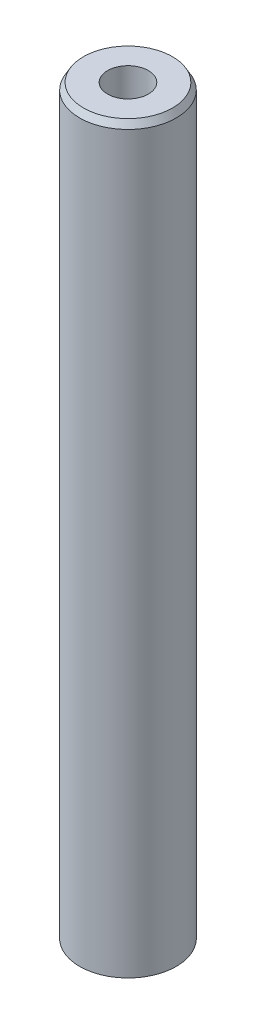
ISO-10303-21;
HEADER;
FILE_DESCRIPTION(('STEP AP214'),'2;1');
FILE_NAME('part.step','',(''),(''),'','','');
FILE_SCHEMA(('AUTOMOTIVE_DESIGN { 1 0 10303 214 1 1 1 1 }'));
ENDSEC;
DATA;
#1=APPLICATION_CONTEXT('core data for automotive mechanical design processes');
#2=APPLICATION_PROTOCOL_DEFINITION('international standard','automotive_design',2000,#1);
#3=PRODUCT_CONTEXT('',#1,'mechanical');
#4=PRODUCT('Part','Part','',(#3));
#5=PRODUCT_RELATED_PRODUCT_CATEGORY('part','',(#4));
#6=PRODUCT_DEFINITION_FORMATION('','',#4);
#7=PRODUCT_DEFINITION_CONTEXT('part definition',#1,'design');
#8=PRODUCT_DEFINITION('design','',#6,#7);
#9=PRODUCT_DEFINITION_SHAPE('','',#8);
#10=(LENGTH_UNIT() NAMED_UNIT(*) SI_UNIT(.MILLI.,.METRE.));
#11=(NAMED_UNIT(*) PLANE_ANGLE_UNIT() SI_UNIT($,.RADIAN.));
#12=(NAMED_UNIT(*) SI_UNIT($,.STERADIAN.) SOLID_ANGLE_UNIT());
#13=UNCERTAINTY_MEASURE_WITH_UNIT(LENGTH_MEASURE(1.E-05),#10,'distance_accuracy_value','');
#14=(GEOMETRIC_REPRESENTATION_CONTEXT(3) GLOBAL_UNCERTAINTY_ASSIGNED_CONTEXT((#13)) GLOBAL_UNIT_ASSIGNED_CONTEXT((#10,
#11,#12)) REPRESENTATION_CONTEXT('',''));
#15=CARTESIAN_POINT('',(0.,0.,0.));
#16=DIRECTION('',(0.,0.,1.));
#17=DIRECTION('',(1.,0.,0.));
#18=AXIS2_PLACEMENT_3D('',#15,#16,#17);
#19=CARTESIAN_POINT('',(0.,115.641286848316,0.));
#20=DIRECTION('',(0.,-1.,0.));
#21=DIRECTION('',(0.,0.,-1.));
#22=AXIS2_PLACEMENT_3D('',#19,#20,#21);
#23=CYLINDRICAL_SURFACE('',#22,7.5);
#24=CARTESIAN_POINT('',(0.,114.605535051166,0.));
#25=DIRECTION('',(0.,1.,0.));
#26=DIRECTION('',(0.,0.,1.));
#27=AXIS2_PLACEMENT_3D('',#24,#25,#26);
#28=CIRCLE('',#27,7.5);
#29=CARTESIAN_POINT('',(0.,114.605535051166,7.5));
#30=VERTEX_POINT('',#29);
#31=EDGE_CURVE('E50',#30,#30,#28,.F.);
#32=ORIENTED_EDGE('',*,*,#31,.T.);
#33=EDGE_LOOP('',(#32));
#34=FACE_BOUND('',#33,.T.);
#35=CARTESIAN_POINT('',(0.,0.597991578897963,0.));
#36=DIRECTION('',(0.,1.,0.));
#37=DIRECTION('',(0.,0.,1.));
#38=AXIS2_PLACEMENT_3D('',#35,#36,#37);
#39=CIRCLE('',#38,7.5);
#40=CARTESIAN_POINT('',(0.,0.597991578897963,7.5));
#41=VERTEX_POINT('',#40);
#42=EDGE_CURVE('E51',#41,#41,#39,.T.);
#43=ORIENTED_EDGE('',*,*,#42,.T.);
#44=EDGE_LOOP('',(#43));
#45=FACE_BOUND('',#44,.T.);
#46=ADVANCED_FACE('F39',(#34,#45),#23,.T.);
#47=CARTESIAN_POINT('',(0.,115.641286848316,0.));
#48=DIRECTION('',(0.,1.,0.));
#49=DIRECTION('',(0.,0.,1.));
#50=AXIS2_PLACEMENT_3D('',#47,#48,#49);
#51=PLANE('',#50);
#52=CARTESIAN_POINT('',(0.,115.641286848316,0.));
#53=DIRECTION('',(0.,1.,0.));
#54=DIRECTION('',(0.,0.,1.));
#55=AXIS2_PLACEMENT_3D('',#52,#53,#54);
#56=CIRCLE('',#55,6.90200842110203);
#57=CARTESIAN_POINT('',(0.,115.641286848316,6.90200842110203));
#58=VERTEX_POINT('',#57);
#59=EDGE_CURVE('E54',#58,#58,#56,.T.);
#60=ORIENTED_EDGE('',*,*,#59,.T.);
#61=EDGE_LOOP('',(#60));
#62=FACE_BOUND('',#61,.T.);
#63=CARTESIAN_POINT('',(0.,115.641286848316,0.));
#64=DIRECTION('',(0.,1.,0.));
#65=DIRECTION('',(0.,0.,1.));
#66=AXIS2_PLACEMENT_3D('',#63,#64,#65);
#67=CIRCLE('',#66,3.16591575502635);
#68=CARTESIAN_POINT('',(0.,115.641286848316,3.16591575502635));
#69=VERTEX_POINT('',#68);
#70=EDGE_CURVE('E58',#69,#69,#67,.T.);
#71=ORIENTED_EDGE('',*,*,#70,.F.);
#72=EDGE_LOOP('',(#71));
#73=FACE_BOUND('',#72,.T.);
#74=ADVANCED_FACE('F69',(#62,#73),#51,.T.);
#75=CARTESIAN_POINT('',(0.,0.,0.));
#76=DIRECTION('',(0.,1.,0.));
#77=DIRECTION('',(0.,0.,1.));
#78=AXIS2_PLACEMENT_3D('',#75,#76,#77);
#79=PLANE('',#78);
#80=CARTESIAN_POINT('',(0.,0.,0.));
#81=DIRECTION('',(0.,1.,0.));
#82=DIRECTION('',(0.,0.,1.));
#83=AXIS2_PLACEMENT_3D('',#80,#81,#82);
#84=CIRCLE('',#83,6.46424820285041);
#85=CARTESIAN_POINT('',(0.,0.,6.46424820285041));
#86=VERTEX_POINT('',#85);
#87=EDGE_CURVE('E10',#86,#86,#84,.F.);
#88=ORIENTED_EDGE('',*,*,#87,.T.);
#89=EDGE_LOOP('',(#88));
#90=FACE_BOUND('',#89,.T.);
#91=CARTESIAN_POINT('',(0.,0.,0.));
#92=DIRECTION('',(0.,1.,0.));
#93=DIRECTION('',(0.,0.,1.));
#94=AXIS2_PLACEMENT_3D('',#91,#92,#93);
#95=CIRCLE('',#94,3.16591575502635);
#96=CARTESIAN_POINT('',(0.,0.,3.16591575502635));
#97=VERTEX_POINT('',#96);
#98=EDGE_CURVE('E63',#97,#97,#95,.T.);
#99=ORIENTED_EDGE('',*,*,#98,.T.);
#100=EDGE_LOOP('',(#99));
#101=FACE_BOUND('',#100,.T.);
#102=ADVANCED_FACE('F75',(#90,#101),#79,.F.);
#103=CARTESIAN_POINT('',(0.,115.641286848316,0.));
#104=DIRECTION('',(0.,-1.,0.));
#105=DIRECTION('',(0.,0.,-1.));
#106=AXIS2_PLACEMENT_3D('',#103,#104,#105);
#107=CYLINDRICAL_SURFACE('',#106,3.16591575502635);
#108=ORIENTED_EDGE('',*,*,#70,.T.);
#109=EDGE_LOOP('',(#108));
#110=FACE_BOUND('',#109,.T.);
#111=ORIENTED_EDGE('',*,*,#98,.F.);
#112=EDGE_LOOP('',(#111));
#113=FACE_BOUND('',#112,.T.);
#114=ADVANCED_FACE('F70',(#110,#113),#107,.F.);
#115=CARTESIAN_POINT('',(0.,115.641286848316,0.));
#116=DIRECTION('',(0.,-1.,0.));
#117=DIRECTION('',(0.,0.,-1.));
#118=AXIS2_PLACEMENT_3D('',#115,#116,#117);
#119=CONICAL_SURFACE('',#118,6.90200842110203,0.523598775598296);
#120=ORIENTED_EDGE('',*,*,#31,.F.);
#121=EDGE_LOOP('',(#120));
#122=FACE_BOUND('',#121,.T.);
#123=ORIENTED_EDGE('',*,*,#59,.F.);
#124=EDGE_LOOP('',(#123));
#125=FACE_BOUND('',#124,.T.);
#126=ADVANCED_FACE('F81',(#122,#125),#119,.T.);
#127=CARTESIAN_POINT('',(0.,0.597991578897963,0.));
#128=DIRECTION('',(0.,1.,0.));
#129=DIRECTION('',(0.,0.,1.));
#130=AXIS2_PLACEMENT_3D('',#127,#128,#129);
#131=CONICAL_SURFACE('',#130,7.5,1.04719755119659);
#132=ORIENTED_EDGE('',*,*,#87,.F.);
#133=EDGE_LOOP('',(#132));
#134=FACE_BOUND('',#133,.T.);
#135=ORIENTED_EDGE('',*,*,#42,.F.);
#136=EDGE_LOOP('',(#135));
#137=FACE_BOUND('',#136,.T.);
#138=ADVANCED_FACE('F45',(#134,#137),#131,.T.);
#139=CLOSED_SHELL('',(#46,#74,#102,#114,#126,#138));
#140=MANIFOLD_SOLID_BREP('B2',#139);
#141=ADVANCED_BREP_SHAPE_REPRESENTATION('',(#18,#140),#14);
#142=SHAPE_DEFINITION_REPRESENTATION(#9,#141);
ENDSEC;
END-ISO-10303-21;
